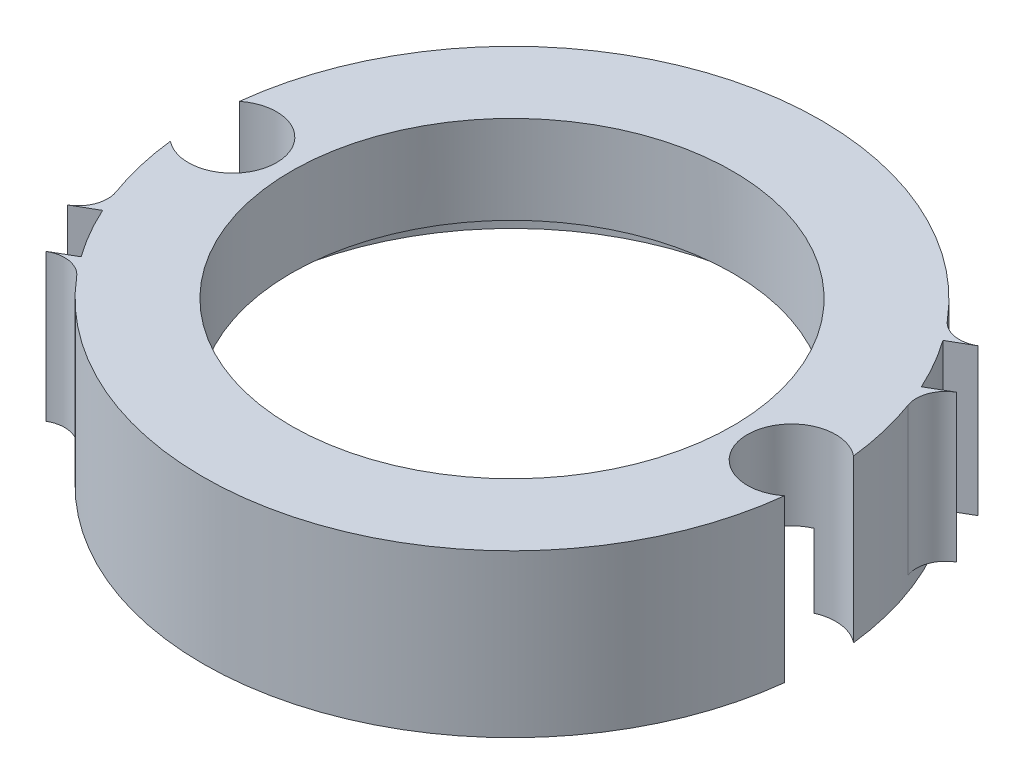
ISO-10303-21;
HEADER;
FILE_DESCRIPTION(('STEP AP214'),'2;1');
FILE_NAME('part.step','',(''),(''),'','','');
FILE_SCHEMA(('AUTOMOTIVE_DESIGN { 1 0 10303 214 1 1 1 1 }'));
ENDSEC;
DATA;
#1=APPLICATION_CONTEXT('core data for automotive mechanical design processes');
#2=APPLICATION_PROTOCOL_DEFINITION('international standard','automotive_design',2000,#1);
#3=PRODUCT_CONTEXT('',#1,'mechanical');
#4=PRODUCT('Part','Part','',(#3));
#5=PRODUCT_RELATED_PRODUCT_CATEGORY('part','',(#4));
#6=PRODUCT_DEFINITION_FORMATION('','',#4);
#7=PRODUCT_DEFINITION_CONTEXT('part definition',#1,'design');
#8=PRODUCT_DEFINITION('design','',#6,#7);
#9=PRODUCT_DEFINITION_SHAPE('','',#8);
#10=(LENGTH_UNIT() NAMED_UNIT(*) SI_UNIT(.MILLI.,.METRE.));
#11=(NAMED_UNIT(*) PLANE_ANGLE_UNIT() SI_UNIT($,.RADIAN.));
#12=(NAMED_UNIT(*) SI_UNIT($,.STERADIAN.) SOLID_ANGLE_UNIT());
#13=UNCERTAINTY_MEASURE_WITH_UNIT(LENGTH_MEASURE(1.E-05),#10,'distance_accuracy_value','');
#14=(GEOMETRIC_REPRESENTATION_CONTEXT(3) GLOBAL_UNCERTAINTY_ASSIGNED_CONTEXT((#13)) GLOBAL_UNIT_ASSIGNED_CONTEXT((#10,
#11,#12)) REPRESENTATION_CONTEXT('',''));
#15=CARTESIAN_POINT('',(0.,0.,0.));
#16=DIRECTION('',(0.,0.,1.));
#17=DIRECTION('',(1.,0.,0.));
#18=AXIS2_PLACEMENT_3D('',#15,#16,#17);
#19=CARTESIAN_POINT('',(8.80752262296651,5.,-7.39442663402194));
#20=DIRECTION('',(0.,-1.,0.));
#21=DIRECTION('',(0.,0.,-1.));
#22=AXIS2_PLACEMENT_3D('',#19,#20,#21);
#23=CYLINDRICAL_SURFACE('',#22,1.);
#24=CARTESIAN_POINT('',(0.,0.7,0.));
#25=DIRECTION('',(0.,-1.,0.));
#26=DIRECTION('',(0.,0.,-1.));
#27=AXIS2_PLACEMENT_3D('',#24,#25,#26);
#28=CIRCLE('',#27,10.5);
#29=CARTESIAN_POINT('',(8.04165109053465,0.7,-6.75143301367221));
#30=VERTEX_POINT('',#29);
#31=CARTESIAN_POINT('',(8.04346665274926,0.7,-6.74926990170868));
#32=VERTEX_POINT('',#31);
#33=EDGE_CURVE('E205',#30,#32,#28,.T.);
#34=ORIENTED_EDGE('',*,*,#33,.F.);
#35=DIRECTION('',(0.,-1.,0.));
#36=VECTOR('',#35,1.);
#37=CARTESIAN_POINT('',(8.04165109053465,5.,-6.75143301367221));
#38=LINE('',#37,#36);
#39=CARTESIAN_POINT('',(8.04165109053465,5.,-6.75143301367221));
#40=VERTEX_POINT('',#39);
#41=EDGE_CURVE('E332',#40,#30,#38,.T.);
#42=ORIENTED_EDGE('',*,*,#41,.F.);
#43=CARTESIAN_POINT('',(8.80752262296651,5.,-7.39442663402194));
#44=DIRECTION('',(0.,1.,0.));
#45=DIRECTION('',(0.,0.,1.));
#46=AXIS2_PLACEMENT_3D('',#43,#44,#45);
#47=CIRCLE('',#46,1.);
#48=CARTESIAN_POINT('',(9.30752262296651,5.,-6.5284012302375));
#49=VERTEX_POINT('',#48);
#50=EDGE_CURVE('E272',#49,#40,#47,.F.);
#51=ORIENTED_EDGE('',*,*,#50,.F.);
#52=DIRECTION('',(0.,-1.,0.));
#53=VECTOR('',#52,1.);
#54=CARTESIAN_POINT('',(9.30752262296651,0.,-6.5284012302375));
#55=LINE('',#54,#53);
#56=CARTESIAN_POINT('',(9.30752262296651,0.,-6.5284012302375));
#57=VERTEX_POINT('',#56);
#58=EDGE_CURVE('E342',#57,#49,#55,.F.);
#59=ORIENTED_EDGE('',*,*,#58,.F.);
#60=CARTESIAN_POINT('',(8.80752262296651,0.,-7.39442663402194));
#61=DIRECTION('',(0.,1.,0.));
#62=DIRECTION('',(0.,0.,1.));
#63=AXIS2_PLACEMENT_3D('',#60,#61,#62);
#64=CIRCLE('',#63,1.);
#65=CARTESIAN_POINT('',(8.04346665274926,0.,-6.74926990170868));
#66=VERTEX_POINT('',#65);
#67=EDGE_CURVE('E270',#66,#57,#64,.T.);
#68=ORIENTED_EDGE('',*,*,#67,.F.);
#69=DIRECTION('',(0.,-1.,0.));
#70=VECTOR('',#69,1.);
#71=CARTESIAN_POINT('',(8.04346665274926,0.7,-6.74926990170868));
#72=LINE('',#71,#70);
#73=EDGE_CURVE('E39',#32,#66,#72,.T.);
#74=ORIENTED_EDGE('',*,*,#73,.F.);
#75=EDGE_LOOP('',(#34,#42,#51,#59,#68,#74));
#76=FACE_BOUND('',#75,.T.);
#77=ADVANCED_FACE('F35',(#76),#23,.F.);
#78=CARTESIAN_POINT('',(0.,-0.5,0.));
#79=DIRECTION('',(0.,1.,0.));
#80=DIRECTION('',(0.,0.,1.));
#81=AXIS2_PLACEMENT_3D('',#78,#79,#80);
#82=PLANE('',#81);
#83=DIRECTION('',(0.766044443118977,0.,-0.642787609686541));
#84=VECTOR('',#83,1.);
#85=CARTESIAN_POINT('',(0.,-0.5,0.));
#86=LINE('',#85,#84);
#87=CARTESIAN_POINT('',(6.89439998807079,-0.5,-5.78508848717887));
#88=VERTEX_POINT('',#87);
#89=CARTESIAN_POINT('',(8.04346665274926,-0.5,-6.74926990170868));
#90=VERTEX_POINT('',#89);
#91=EDGE_CURVE('E300',#88,#90,#86,.T.);
#92=ORIENTED_EDGE('',*,*,#91,.T.);
#93=CARTESIAN_POINT('',(0.,-0.5,0.));
#94=DIRECTION('',(0.,1.,0.));
#95=DIRECTION('',(0.,0.,1.));
#96=AXIS2_PLACEMENT_3D('',#93,#94,#95);
#97=CIRCLE('',#96,10.5);
#98=CARTESIAN_POINT('',(10.4342105263158,-0.5,-1.17356324606763));
#99=VERTEX_POINT('',#98);
#100=EDGE_CURVE('E256',#99,#90,#97,.T.);
#101=ORIENTED_EDGE('',*,*,#100,.F.);
#102=CARTESIAN_POINT('',(9.5,-0.5,0.));
#103=DIRECTION('',(0.,1.,0.));
#104=DIRECTION('',(0.,0.,1.));
#105=AXIS2_PLACEMENT_3D('',#102,#103,#104);
#106=CIRCLE('',#105,1.50000000000001);
#107=CARTESIAN_POINT('',(8.89473684210526,-0.5,-1.3724636642532));
#108=VERTEX_POINT('',#107);
#109=EDGE_CURVE('E219',#99,#108,#106,.T.);
#110=ORIENTED_EDGE('',*,*,#109,.T.);
#111=CARTESIAN_POINT('',(0.,-0.5,0.));
#112=DIRECTION('',(0.,-1.,0.));
#113=DIRECTION('',(0.,0.,-1.));
#114=AXIS2_PLACEMENT_3D('',#111,#112,#113);
#115=CIRCLE('',#114,9.);
#116=EDGE_CURVE('E298',#88,#108,#115,.T.);
#117=ORIENTED_EDGE('',*,*,#116,.F.);
#118=EDGE_LOOP('',(#92,#101,#110,#117));
#119=FACE_BOUND('',#118,.T.);
#120=ADVANCED_FACE('F297',(#119),#82,.F.);
#121=CARTESIAN_POINT('',(0.,5.,0.));
#122=DIRECTION('',(0.,-1.,0.));
#123=DIRECTION('',(0.,0.,-1.));
#124=AXIS2_PLACEMENT_3D('',#121,#122,#123);
#125=CYLINDRICAL_SURFACE('',#124,10.5);
#126=EDGE_CURVE('E274',#66,#90,#72,.T.);
#127=ORIENTED_EDGE('',*,*,#126,.F.);
#128=CARTESIAN_POINT('',(0.,0.,0.));
#129=DIRECTION('',(0.,1.,0.));
#130=DIRECTION('',(0.,0.,1.));
#131=AXIS2_PLACEMENT_3D('',#128,#129,#130);
#132=CIRCLE('',#131,10.5);
#133=CARTESIAN_POINT('',(8.55193349511584,0.,-6.09216164387616));
#134=VERTEX_POINT('',#133);
#135=EDGE_CURVE('E262',#134,#66,#132,.T.);
#136=ORIENTED_EDGE('',*,*,#135,.F.);
#137=DIRECTION('',(0.,1.,0.));
#138=VECTOR('',#137,1.);
#139=CARTESIAN_POINT('',(8.55193349511584,-0.5,-6.09216164387616));
#140=LINE('',#139,#138);
#141=CARTESIAN_POINT('',(8.55193349511584,5.,-6.09216164387616));
#142=VERTEX_POINT('',#141);
#143=EDGE_CURVE('E229',#134,#142,#140,.T.);
#144=ORIENTED_EDGE('',*,*,#143,.T.);
#145=CARTESIAN_POINT('',(0.,5.,0.));
#146=DIRECTION('',(0.,1.,0.));
#147=DIRECTION('',(0.,0.,1.));
#148=AXIS2_PLACEMENT_3D('',#145,#146,#147);
#149=CIRCLE('',#148,10.5);
#150=CARTESIAN_POINT('',(9.55193349511584,5.,-4.36011083630728));
#151=VERTEX_POINT('',#150);
#152=EDGE_CURVE('E261',#151,#142,#149,.T.);
#153=ORIENTED_EDGE('',*,*,#152,.F.);
#154=DIRECTION('',(0.,1.,0.));
#155=VECTOR('',#154,1.);
#156=CARTESIAN_POINT('',(9.55193349511584,-0.5,-4.36011083630728));
#157=LINE('',#156,#155);
#158=CARTESIAN_POINT('',(9.55193349511584,0.,-4.36011083630728));
#159=VERTEX_POINT('',#158);
#160=EDGE_CURVE('E232',#159,#151,#157,.T.);
#161=ORIENTED_EDGE('',*,*,#160,.F.);
#162=CARTESIAN_POINT('',(9.86773804705638,0.,-3.58855762593774));
#163=VERTEX_POINT('',#162);
#164=EDGE_CURVE('E257',#163,#159,#132,.T.);
#165=ORIENTED_EDGE('',*,*,#164,.F.);
#166=DIRECTION('',(0.,-1.,0.));
#167=VECTOR('',#166,1.);
#168=CARTESIAN_POINT('',(9.86773804705638,5.,-3.58855762593774));
#169=LINE('',#168,#167);
#170=CARTESIAN_POINT('',(9.86773804705638,5.,-3.58855762593774));
#171=VERTEX_POINT('',#170);
#172=EDGE_CURVE('E367',#163,#171,#169,.F.);
#173=ORIENTED_EDGE('',*,*,#172,.T.);
#174=CARTESIAN_POINT('',(0.,5.,0.));
#175=DIRECTION('',(0.,1.,0.));
#176=DIRECTION('',(0.,0.,1.));
#177=AXIS2_PLACEMENT_3D('',#174,#175,#176);
#178=CIRCLE('',#177,10.5);
#179=CARTESIAN_POINT('',(10.4342105263158,5.,-1.17356324606763));
#180=VERTEX_POINT('',#179);
#181=EDGE_CURVE('E363',#180,#171,#178,.T.);
#182=ORIENTED_EDGE('',*,*,#181,.F.);
#183=DIRECTION('',(0.,1.,0.));
#184=VECTOR('',#183,1.);
#185=CARTESIAN_POINT('',(10.4342105263158,-0.5,-1.17356324606763));
#186=LINE('',#185,#184);
#187=EDGE_CURVE('E222',#99,#180,#186,.T.);
#188=ORIENTED_EDGE('',*,*,#187,.F.);
#189=ORIENTED_EDGE('',*,*,#100,.T.);
#190=EDGE_LOOP('',(#127,#136,#144,#153,#161,#165,#173,#182,#188,#189));
#191=FACE_BOUND('',#190,.T.);
#192=ADVANCED_FACE('F389',(#191),#125,.T.);
#193=CARTESIAN_POINT('',(-10.4342105263158,0.7,-1.17356324606763));
#194=VERTEX_POINT('',#193);
#195=EDGE_CURVE('E433',#194,#30,#28,.T.);
#196=ORIENTED_EDGE('',*,*,#195,.F.);
#197=DIRECTION('',(0.,1.,0.));
#198=VECTOR('',#197,1.);
#199=CARTESIAN_POINT('',(-10.4342105263158,-0.5,-1.17356324606763));
#200=LINE('',#199,#198);
#201=CARTESIAN_POINT('',(-10.4342105263158,5.,-1.17356324606763));
#202=VERTEX_POINT('',#201);
#203=EDGE_CURVE('E204',#194,#202,#200,.T.);
#204=ORIENTED_EDGE('',*,*,#203,.T.);
#205=EDGE_CURVE('E460',#40,#202,#178,.T.);
#206=ORIENTED_EDGE('',*,*,#205,.F.);
#207=ORIENTED_EDGE('',*,*,#41,.T.);
#208=EDGE_LOOP('',(#196,#204,#206,#207));
#209=FACE_BOUND('',#208,.T.);
#210=ADVANCED_FACE('F390',(#209),#125,.T.);
#211=CARTESIAN_POINT('',(-9.5,-0.5,0.));
#212=DIRECTION('',(0.,1.,0.));
#213=DIRECTION('',(0.,0.,1.));
#214=AXIS2_PLACEMENT_3D('',#211,#212,#213);
#215=CYLINDRICAL_SURFACE('',#214,1.50000000000001);
#216=CARTESIAN_POINT('',(-9.5,0.7,0.));
#217=DIRECTION('',(0.,-1.,0.));
#218=DIRECTION('',(0.,0.,-1.));
#219=AXIS2_PLACEMENT_3D('',#216,#217,#218);
#220=CIRCLE('',#219,1.50000000000001);
#221=CARTESIAN_POINT('',(-8.89473684210526,0.7,-1.3724636642532));
#222=VERTEX_POINT('',#221);
#223=EDGE_CURVE('E192',#222,#194,#220,.F.);
#224=ORIENTED_EDGE('',*,*,#223,.F.);
#225=DIRECTION('',(0.,-1.,0.));
#226=VECTOR('',#225,1.);
#227=CARTESIAN_POINT('',(-8.89473684210526,0.75,-1.3724636642532));
#228=LINE('',#227,#226);
#229=CARTESIAN_POINT('',(-8.89473684210526,2.,-1.3724636642532));
#230=VERTEX_POINT('',#229);
#231=EDGE_CURVE('E202',#222,#230,#228,.F.);
#232=ORIENTED_EDGE('',*,*,#231,.T.);
#233=CARTESIAN_POINT('',(-9.5,2.,0.));
#234=DIRECTION('',(0.,-1.,0.));
#235=DIRECTION('',(0.,0.,-1.));
#236=AXIS2_PLACEMENT_3D('',#233,#234,#235);
#237=CIRCLE('',#236,1.50000000000001);
#238=CARTESIAN_POINT('',(-8.89473684210526,2.,1.3724636642532));
#239=VERTEX_POINT('',#238);
#240=EDGE_CURVE('E425',#239,#230,#237,.F.);
#241=ORIENTED_EDGE('',*,*,#240,.F.);
#242=DIRECTION('',(0.,-1.,0.));
#243=VECTOR('',#242,1.);
#244=CARTESIAN_POINT('',(-8.89473684210526,0.75,1.3724636642532));
#245=LINE('',#244,#243);
#246=CARTESIAN_POINT('',(-8.89473684210526,-0.5,1.3724636642532));
#247=VERTEX_POINT('',#246);
#248=EDGE_CURVE('E209',#239,#247,#245,.T.);
#249=ORIENTED_EDGE('',*,*,#248,.T.);
#250=CARTESIAN_POINT('',(-9.5,-0.5,0.));
#251=DIRECTION('',(0.,1.,0.));
#252=DIRECTION('',(0.,0.,1.));
#253=AXIS2_PLACEMENT_3D('',#250,#251,#252);
#254=CIRCLE('',#253,1.50000000000001);
#255=CARTESIAN_POINT('',(-10.4342105263158,-0.5,1.17356324606764));
#256=VERTEX_POINT('',#255);
#257=EDGE_CURVE('E227',#256,#247,#254,.T.);
#258=ORIENTED_EDGE('',*,*,#257,.F.);
#259=DIRECTION('',(0.,1.,0.));
#260=VECTOR('',#259,1.);
#261=CARTESIAN_POINT('',(-10.4342105263158,-0.5,1.17356324606764));
#262=LINE('',#261,#260);
#263=CARTESIAN_POINT('',(-10.4342105263158,5.,1.17356324606764));
#264=VERTEX_POINT('',#263);
#265=EDGE_CURVE('E452',#256,#264,#262,.T.);
#266=ORIENTED_EDGE('',*,*,#265,.T.);
#267=CARTESIAN_POINT('',(-9.5,5.,0.));
#268=DIRECTION('',(0.,1.,0.));
#269=DIRECTION('',(0.,0.,1.));
#270=AXIS2_PLACEMENT_3D('',#267,#268,#269);
#271=CIRCLE('',#270,1.5);
#272=EDGE_CURVE('E464',#264,#202,#271,.T.);
#273=ORIENTED_EDGE('',*,*,#272,.T.);
#274=ORIENTED_EDGE('',*,*,#203,.F.);
#275=EDGE_LOOP('',(#224,#232,#241,#249,#258,#266,#273,#274));
#276=FACE_BOUND('',#275,.T.);
#277=ADVANCED_FACE('F200',(#276),#215,.F.);
#278=CARTESIAN_POINT('',(0.,2.,0.));
#279=DIRECTION('',(0.,-1.,0.));
#280=DIRECTION('',(0.,0.,-1.));
#281=AXIS2_PLACEMENT_3D('',#278,#279,#280);
#282=CYLINDRICAL_SURFACE('',#281,9.);
#283=DIRECTION('',(0.,-1.,0.));
#284=VECTOR('',#283,1.);
#285=CARTESIAN_POINT('',(6.89439998807079,0.7,-5.78508848717887));
#286=LINE('',#285,#284);
#287=CARTESIAN_POINT('',(6.89439998807079,0.7,-5.78508848717887));
#288=VERTEX_POINT('',#287);
#289=EDGE_CURVE('E432',#288,#88,#286,.T.);
#290=ORIENTED_EDGE('',*,*,#289,.T.);
#291=ORIENTED_EDGE('',*,*,#116,.T.);
#292=DIRECTION('',(0.,-1.,0.));
#293=VECTOR('',#292,1.);
#294=CARTESIAN_POINT('',(8.89473684210526,0.75,-1.3724636642532));
#295=LINE('',#294,#293);
#296=CARTESIAN_POINT('',(8.89473684210526,2.,-1.3724636642532));
#297=VERTEX_POINT('',#296);
#298=EDGE_CURVE('E45',#297,#108,#295,.T.);
#299=ORIENTED_EDGE('',*,*,#298,.F.);
#300=CARTESIAN_POINT('',(0.,2.,0.));
#301=DIRECTION('',(0.,-1.,0.));
#302=DIRECTION('',(0.,0.,-1.));
#303=AXIS2_PLACEMENT_3D('',#300,#301,#302);
#304=CIRCLE('',#303,9.);
#305=EDGE_CURVE('E61',#230,#297,#304,.T.);
#306=ORIENTED_EDGE('',*,*,#305,.F.);
#307=ORIENTED_EDGE('',*,*,#231,.F.);
#308=CARTESIAN_POINT('',(0.,0.7,0.));
#309=DIRECTION('',(0.,-1.,0.));
#310=DIRECTION('',(0.,0.,-1.));
#311=AXIS2_PLACEMENT_3D('',#308,#309,#310);
#312=CIRCLE('',#311,9.);
#313=EDGE_CURVE('E189',#288,#222,#312,.F.);
#314=ORIENTED_EDGE('',*,*,#313,.F.);
#315=EDGE_LOOP('',(#290,#291,#299,#306,#307,#314));
#316=FACE_BOUND('',#315,.T.);
#317=ADVANCED_FACE('F207',(#316),#282,.F.);
#318=CARTESIAN_POINT('',(0.,-0.5,0.));
#319=DIRECTION('',(0.,1.,0.));
#320=DIRECTION('',(0.,0.,1.));
#321=AXIS2_PLACEMENT_3D('',#318,#319,#320);
#322=CYLINDRICAL_SURFACE('',#321,7.5);
#323=CARTESIAN_POINT('',(0.,5.,0.));
#324=DIRECTION('',(0.,1.,0.));
#325=DIRECTION('',(0.,0.,1.));
#326=AXIS2_PLACEMENT_3D('',#323,#324,#325);
#327=CIRCLE('',#326,7.5);
#328=CARTESIAN_POINT('',(0.,5.,7.5));
#329=VERTEX_POINT('',#328);
#330=EDGE_CURVE('E250',#329,#329,#327,.T.);
#331=ORIENTED_EDGE('',*,*,#330,.T.);
#332=EDGE_LOOP('',(#331));
#333=FACE_BOUND('',#332,.T.);
#334=CARTESIAN_POINT('',(0.,2.,0.));
#335=DIRECTION('',(0.,-1.,0.));
#336=DIRECTION('',(0.,0.,-1.));
#337=AXIS2_PLACEMENT_3D('',#334,#335,#336);
#338=CIRCLE('',#337,7.5);
#339=CARTESIAN_POINT('',(0.,2.,-7.5));
#340=VERTEX_POINT('',#339);
#341=EDGE_CURVE('E215',#340,#340,#338,.F.);
#342=ORIENTED_EDGE('',*,*,#341,.F.);
#343=EDGE_LOOP('',(#342));
#344=FACE_BOUND('',#343,.T.);
#345=ADVANCED_FACE('F394',(#333,#344),#322,.F.);
#346=CARTESIAN_POINT('',(0.,0.,0.));
#347=DIRECTION('',(0.,1.,0.));
#348=DIRECTION('',(0.,0.,1.));
#349=AXIS2_PLACEMENT_3D('',#346,#347,#348);
#350=PLANE('',#349);
#351=ORIENTED_EDGE('',*,*,#135,.T.);
#352=ORIENTED_EDGE('',*,*,#67,.T.);
#353=DIRECTION('',(-0.866025403784439,0.,0.5));
#354=VECTOR('',#353,1.);
#355=CARTESIAN_POINT('',(-0.5,0.,-0.866025403784438));
#356=LINE('',#355,#354);
#357=EDGE_CURVE('E242',#57,#134,#356,.T.);
#358=ORIENTED_EDGE('',*,*,#357,.T.);
#359=EDGE_LOOP('',(#351,#352,#358));
#360=FACE_BOUND('',#359,.T.);
#361=ADVANCED_FACE('F381',(#360),#350,.F.);
#362=CARTESIAN_POINT('',(10.4342105263158,-0.5,1.17356324606763));
#363=VERTEX_POINT('',#362);
#364=EDGE_CURVE('E253',#256,#363,#97,.T.);
#365=ORIENTED_EDGE('',*,*,#364,.T.);
#366=DIRECTION('',(0.,1.,0.));
#367=VECTOR('',#366,1.);
#368=CARTESIAN_POINT('',(10.4342105263158,-0.5,1.17356324606763));
#369=LINE('',#368,#367);
#370=CARTESIAN_POINT('',(10.4342105263158,5.,1.17356324606763));
#371=VERTEX_POINT('',#370);
#372=EDGE_CURVE('E224',#363,#371,#369,.T.);
#373=ORIENTED_EDGE('',*,*,#372,.T.);
#374=CARTESIAN_POINT('',(-8.04165109053465,5.,6.75143301367221));
#375=VERTEX_POINT('',#374);
#376=EDGE_CURVE('E355',#375,#371,#178,.T.);
#377=ORIENTED_EDGE('',*,*,#376,.F.);
#378=DIRECTION('',(0.,-1.,0.));
#379=VECTOR('',#378,1.);
#380=CARTESIAN_POINT('',(-8.04165109053465,5.,6.75143301367221));
#381=LINE('',#380,#379);
#382=CARTESIAN_POINT('',(-8.04165109053465,0.,6.75143301367221));
#383=VERTEX_POINT('',#382);
#384=EDGE_CURVE('E361',#375,#383,#381,.T.);
#385=ORIENTED_EDGE('',*,*,#384,.T.);
#386=CARTESIAN_POINT('',(-8.55193349511584,0.,6.09216164387616));
#387=VERTEX_POINT('',#386);
#388=EDGE_CURVE('E263',#387,#383,#132,.T.);
#389=ORIENTED_EDGE('',*,*,#388,.F.);
#390=DIRECTION('',(0.,1.,0.));
#391=VECTOR('',#390,1.);
#392=CARTESIAN_POINT('',(-8.55193349511584,-0.5,6.09216164387616));
#393=LINE('',#392,#391);
#394=CARTESIAN_POINT('',(-8.55193349511584,5.,6.09216164387616));
#395=VERTEX_POINT('',#394);
#396=EDGE_CURVE('E208',#387,#395,#393,.T.);
#397=ORIENTED_EDGE('',*,*,#396,.T.);
#398=CARTESIAN_POINT('',(0.,5.,0.));
#399=DIRECTION('',(0.,1.,0.));
#400=DIRECTION('',(0.,0.,1.));
#401=AXIS2_PLACEMENT_3D('',#398,#399,#400);
#402=CIRCLE('',#401,10.5);
#403=CARTESIAN_POINT('',(-9.55193349511584,5.,4.36011083630728));
#404=VERTEX_POINT('',#403);
#405=EDGE_CURVE('E321',#404,#395,#402,.T.);
#406=ORIENTED_EDGE('',*,*,#405,.F.);
#407=DIRECTION('',(0.,1.,0.));
#408=VECTOR('',#407,1.);
#409=CARTESIAN_POINT('',(-9.55193349511584,-0.5,4.36011083630728));
#410=LINE('',#409,#408);
#411=CARTESIAN_POINT('',(-9.55193349511584,0.,4.36011083630728));
#412=VERTEX_POINT('',#411);
#413=EDGE_CURVE('E212',#412,#404,#410,.T.);
#414=ORIENTED_EDGE('',*,*,#413,.F.);
#415=CARTESIAN_POINT('',(-9.86773804705638,0.,3.58855762593774));
#416=VERTEX_POINT('',#415);
#417=EDGE_CURVE('E264',#416,#412,#132,.T.);
#418=ORIENTED_EDGE('',*,*,#417,.F.);
#419=DIRECTION('',(0.,-1.,0.));
#420=VECTOR('',#419,1.);
#421=CARTESIAN_POINT('',(-9.86773804705638,5.,3.58855762593774));
#422=LINE('',#421,#420);
#423=CARTESIAN_POINT('',(-9.86773804705638,5.,3.58855762593774));
#424=VERTEX_POINT('',#423);
#425=EDGE_CURVE('E318',#416,#424,#422,.F.);
#426=ORIENTED_EDGE('',*,*,#425,.T.);
#427=EDGE_CURVE('E364',#264,#424,#178,.T.);
#428=ORIENTED_EDGE('',*,*,#427,.F.);
#429=ORIENTED_EDGE('',*,*,#265,.F.);
#430=EDGE_LOOP('',(#365,#373,#377,#385,#389,#397,#406,#414,#418,#426,#428,#429));
#431=FACE_BOUND('',#430,.T.);
#432=ADVANCED_FACE('F316',(#431),#125,.T.);
#433=CARTESIAN_POINT('',(-8.80752262296652,0.,7.39442663402194));
#434=DIRECTION('',(0.,1.,0.));
#435=DIRECTION('',(0.,0.,1.));
#436=AXIS2_PLACEMENT_3D('',#433,#434,#435);
#437=CIRCLE('',#436,1.);
#438=CARTESIAN_POINT('',(-9.30752262296652,0.,6.5284012302375));
#439=VERTEX_POINT('',#438);
#440=EDGE_CURVE('E348',#383,#439,#437,.T.);
#441=ORIENTED_EDGE('',*,*,#440,.T.);
#442=DIRECTION('',(0.866025403784439,0.,-0.5));
#443=VECTOR('',#442,1.);
#444=CARTESIAN_POINT('',(0.499999999999999,0.,0.866025403784436));
#445=LINE('',#444,#443);
#446=EDGE_CURVE('E247',#439,#387,#445,.T.);
#447=ORIENTED_EDGE('',*,*,#446,.T.);
#448=ORIENTED_EDGE('',*,*,#388,.T.);
#449=EDGE_LOOP('',(#441,#447,#448));
#450=FACE_BOUND('',#449,.T.);
#451=ADVANCED_FACE('F377',(#450),#350,.F.);
#452=ORIENTED_EDGE('',*,*,#164,.T.);
#453=DIRECTION('',(0.866025403784439,0.,-0.5));
#454=VECTOR('',#453,1.);
#455=CARTESIAN_POINT('',(0.499999999999999,0.,0.866025403784437));
#456=LINE('',#455,#454);
#457=CARTESIAN_POINT('',(10.3075226229665,0.,-4.79635042266863));
#458=VERTEX_POINT('',#457);
#459=EDGE_CURVE('E449',#159,#458,#456,.T.);
#460=ORIENTED_EDGE('',*,*,#459,.T.);
#461=CARTESIAN_POINT('',(10.8075226229665,0.,-3.93032501888419));
#462=DIRECTION('',(0.,1.,0.));
#463=DIRECTION('',(0.,0.,1.));
#464=AXIS2_PLACEMENT_3D('',#461,#462,#463);
#465=CIRCLE('',#464,1.);
#466=EDGE_CURVE('E284',#458,#163,#465,.T.);
#467=ORIENTED_EDGE('',*,*,#466,.T.);
#468=EDGE_LOOP('',(#452,#460,#467));
#469=FACE_BOUND('',#468,.T.);
#470=ADVANCED_FACE('F379',(#469),#350,.F.);
#471=CARTESIAN_POINT('',(0.,5.,0.));
#472=DIRECTION('',(0.,1.,0.));
#473=DIRECTION('',(0.,0.,1.));
#474=AXIS2_PLACEMENT_3D('',#471,#472,#473);
#475=PLANE('',#474);
#476=ORIENTED_EDGE('',*,*,#330,.F.);
#477=EDGE_LOOP('',(#476));
#478=FACE_BOUND('',#477,.T.);
#479=CARTESIAN_POINT('',(-8.80752262296652,5.,7.39442663402194));
#480=DIRECTION('',(0.,1.,0.));
#481=DIRECTION('',(0.,0.,1.));
#482=AXIS2_PLACEMENT_3D('',#479,#480,#481);
#483=CIRCLE('',#482,1.);
#484=CARTESIAN_POINT('',(-9.30752262296652,5.,6.5284012302375));
#485=VERTEX_POINT('',#484);
#486=EDGE_CURVE('E350',#485,#375,#483,.F.);
#487=ORIENTED_EDGE('',*,*,#486,.T.);
#488=ORIENTED_EDGE('',*,*,#376,.T.);
#489=CARTESIAN_POINT('',(9.5,5.,0.));
#490=DIRECTION('',(0.,1.,0.));
#491=DIRECTION('',(0.,0.,1.));
#492=AXIS2_PLACEMENT_3D('',#489,#490,#491);
#493=CIRCLE('',#492,1.5);
#494=EDGE_CURVE('E372',#180,#371,#493,.T.);
#495=ORIENTED_EDGE('',*,*,#494,.F.);
#496=ORIENTED_EDGE('',*,*,#181,.T.);
#497=CARTESIAN_POINT('',(10.8075226229665,5.,-3.93032501888419));
#498=DIRECTION('',(0.,1.,0.));
#499=DIRECTION('',(0.,0.,1.));
#500=AXIS2_PLACEMENT_3D('',#497,#498,#499);
#501=CIRCLE('',#500,1.);
#502=CARTESIAN_POINT('',(10.3075226229665,5.,-4.79635042266863));
#503=VERTEX_POINT('',#502);
#504=EDGE_CURVE('E281',#171,#503,#501,.F.);
#505=ORIENTED_EDGE('',*,*,#504,.T.);
#506=DIRECTION('',(0.866025403784439,0.,-0.5));
#507=VECTOR('',#506,1.);
#508=CARTESIAN_POINT('',(0.499999999999999,5.,0.866025403784436));
#509=LINE('',#508,#507);
#510=EDGE_CURVE('E346',#151,#503,#509,.T.);
#511=ORIENTED_EDGE('',*,*,#510,.F.);
#512=ORIENTED_EDGE('',*,*,#152,.T.);
#513=DIRECTION('',(-0.866025403784439,0.,0.5));
#514=VECTOR('',#513,1.);
#515=CARTESIAN_POINT('',(-0.499999999999999,5.,-0.866025403784436));
#516=LINE('',#515,#514);
#517=EDGE_CURVE('E336',#49,#142,#516,.T.);
#518=ORIENTED_EDGE('',*,*,#517,.F.);
#519=ORIENTED_EDGE('',*,*,#50,.T.);
#520=ORIENTED_EDGE('',*,*,#205,.T.);
#521=ORIENTED_EDGE('',*,*,#272,.F.);
#522=ORIENTED_EDGE('',*,*,#427,.T.);
#523=CARTESIAN_POINT('',(-10.8075226229665,5.,3.93032501888419));
#524=DIRECTION('',(0.,1.,0.));
#525=DIRECTION('',(0.,0.,1.));
#526=AXIS2_PLACEMENT_3D('',#523,#524,#525);
#527=CIRCLE('',#526,1.);
#528=CARTESIAN_POINT('',(-10.3075226229665,5.,4.79635042266863));
#529=VERTEX_POINT('',#528);
#530=EDGE_CURVE('E330',#424,#529,#527,.F.);
#531=ORIENTED_EDGE('',*,*,#530,.T.);
#532=DIRECTION('',(-0.866025403784439,0.,0.5));
#533=VECTOR('',#532,1.);
#534=CARTESIAN_POINT('',(-0.499999999999999,5.,-0.866025403784436));
#535=LINE('',#534,#533);
#536=EDGE_CURVE('E325',#404,#529,#535,.T.);
#537=ORIENTED_EDGE('',*,*,#536,.F.);
#538=ORIENTED_EDGE('',*,*,#405,.T.);
#539=DIRECTION('',(0.866025403784439,0.,-0.5));
#540=VECTOR('',#539,1.);
#541=CARTESIAN_POINT('',(0.499999999999999,5.,0.866025403784436));
#542=LINE('',#541,#540);
#543=EDGE_CURVE('E356',#485,#395,#542,.T.);
#544=ORIENTED_EDGE('',*,*,#543,.F.);
#545=EDGE_LOOP('',(#487,#488,#495,#496,#505,#511,#512,#518,#519,#520,#521,#522,#531,#537,#538,#544));
#546=FACE_BOUND('',#545,.T.);
#547=ADVANCED_FACE('F328',(#478,#546),#475,.T.);
#548=ORIENTED_EDGE('',*,*,#417,.T.);
#549=DIRECTION('',(-0.866025403784439,0.,0.5));
#550=VECTOR('',#549,1.);
#551=CARTESIAN_POINT('',(-0.499999999999999,0.,-0.866025403784436));
#552=LINE('',#551,#550);
#553=CARTESIAN_POINT('',(-10.3075226229665,0.,4.79635042266863));
#554=VERTEX_POINT('',#553);
#555=EDGE_CURVE('E244',#412,#554,#552,.T.);
#556=ORIENTED_EDGE('',*,*,#555,.T.);
#557=CARTESIAN_POINT('',(-10.8075226229665,0.,3.93032501888419));
#558=DIRECTION('',(0.,1.,0.));
#559=DIRECTION('',(0.,0.,1.));
#560=AXIS2_PLACEMENT_3D('',#557,#558,#559);
#561=CIRCLE('',#560,1.);
#562=EDGE_CURVE('E273',#554,#416,#561,.T.);
#563=ORIENTED_EDGE('',*,*,#562,.T.);
#564=EDGE_LOOP('',(#548,#556,#563));
#565=FACE_BOUND('',#564,.T.);
#566=ADVANCED_FACE('F310',(#565),#350,.F.);
#567=CARTESIAN_POINT('',(-8.80752262296652,5.,7.39442663402194));
#568=DIRECTION('',(0.,-1.,0.));
#569=DIRECTION('',(0.,0.,-1.));
#570=AXIS2_PLACEMENT_3D('',#567,#568,#569);
#571=CYLINDRICAL_SURFACE('',#570,1.);
#572=ORIENTED_EDGE('',*,*,#486,.F.);
#573=DIRECTION('',(0.,-1.,0.));
#574=VECTOR('',#573,1.);
#575=CARTESIAN_POINT('',(-9.30752262296652,0.,6.5284012302375));
#576=LINE('',#575,#574);
#577=EDGE_CURVE('E369',#439,#485,#576,.F.);
#578=ORIENTED_EDGE('',*,*,#577,.F.);
#579=ORIENTED_EDGE('',*,*,#440,.F.);
#580=ORIENTED_EDGE('',*,*,#384,.F.);
#581=EDGE_LOOP('',(#572,#578,#579,#580));
#582=FACE_BOUND('',#581,.T.);
#583=ADVANCED_FACE('F366',(#582),#571,.F.);
#584=CARTESIAN_POINT('',(-10.8075226229665,5.,3.93032501888419));
#585=DIRECTION('',(0.,-1.,0.));
#586=DIRECTION('',(0.,0.,-1.));
#587=AXIS2_PLACEMENT_3D('',#584,#585,#586);
#588=CYLINDRICAL_SURFACE('',#587,1.);
#589=ORIENTED_EDGE('',*,*,#562,.F.);
#590=DIRECTION('',(0.,-1.,0.));
#591=VECTOR('',#590,1.);
#592=CARTESIAN_POINT('',(-10.3075226229665,0.,4.79635042266863));
#593=LINE('',#592,#591);
#594=EDGE_CURVE('E333',#529,#554,#593,.T.);
#595=ORIENTED_EDGE('',*,*,#594,.F.);
#596=ORIENTED_EDGE('',*,*,#530,.F.);
#597=ORIENTED_EDGE('',*,*,#425,.F.);
#598=EDGE_LOOP('',(#589,#595,#596,#597));
#599=FACE_BOUND('',#598,.T.);
#600=ADVANCED_FACE('F405',(#599),#588,.F.);
#601=CARTESIAN_POINT('',(10.8075226229665,5.,-3.93032501888419));
#602=DIRECTION('',(0.,-1.,0.));
#603=DIRECTION('',(0.,0.,-1.));
#604=AXIS2_PLACEMENT_3D('',#601,#602,#603);
#605=CYLINDRICAL_SURFACE('',#604,1.);
#606=ORIENTED_EDGE('',*,*,#466,.F.);
#607=DIRECTION('',(0.,-1.,0.));
#608=VECTOR('',#607,1.);
#609=CARTESIAN_POINT('',(10.3075226229665,0.,-4.79635042266863));
#610=LINE('',#609,#608);
#611=EDGE_CURVE('E344',#503,#458,#610,.T.);
#612=ORIENTED_EDGE('',*,*,#611,.F.);
#613=ORIENTED_EDGE('',*,*,#504,.F.);
#614=ORIENTED_EDGE('',*,*,#172,.F.);
#615=EDGE_LOOP('',(#606,#612,#613,#614));
#616=FACE_BOUND('',#615,.T.);
#617=ADVANCED_FACE('F37',(#616),#605,.F.);
#618=ORIENTED_EDGE('',*,*,#257,.T.);
#619=CARTESIAN_POINT('',(8.89473684210526,-0.5,1.3724636642532));
#620=VERTEX_POINT('',#619);
#621=EDGE_CURVE('E430',#620,#247,#115,.T.);
#622=ORIENTED_EDGE('',*,*,#621,.F.);
#623=EDGE_CURVE('E223',#620,#363,#106,.T.);
#624=ORIENTED_EDGE('',*,*,#623,.T.);
#625=ORIENTED_EDGE('',*,*,#364,.F.);
#626=EDGE_LOOP('',(#618,#622,#624,#625));
#627=FACE_BOUND('',#626,.T.);
#628=ADVANCED_FACE('F402',(#627),#82,.F.);
#629=CARTESIAN_POINT('',(9.5,-0.5,0.));
#630=DIRECTION('',(0.,1.,0.));
#631=DIRECTION('',(0.,0.,1.));
#632=AXIS2_PLACEMENT_3D('',#629,#630,#631);
#633=CYLINDRICAL_SURFACE('',#632,1.50000000000001);
#634=ORIENTED_EDGE('',*,*,#623,.F.);
#635=DIRECTION('',(0.,-1.,0.));
#636=VECTOR('',#635,1.);
#637=CARTESIAN_POINT('',(8.89473684210526,0.75,1.3724636642532));
#638=LINE('',#637,#636);
#639=CARTESIAN_POINT('',(8.89473684210526,2.,1.3724636642532));
#640=VERTEX_POINT('',#639);
#641=EDGE_CURVE('E11',#620,#640,#638,.F.);
#642=ORIENTED_EDGE('',*,*,#641,.T.);
#643=CARTESIAN_POINT('',(9.5,2.,0.));
#644=DIRECTION('',(0.,-1.,0.));
#645=DIRECTION('',(0.,0.,-1.));
#646=AXIS2_PLACEMENT_3D('',#643,#644,#645);
#647=CIRCLE('',#646,1.50000000000001);
#648=EDGE_CURVE('E286',#297,#640,#647,.F.);
#649=ORIENTED_EDGE('',*,*,#648,.F.);
#650=ORIENTED_EDGE('',*,*,#298,.T.);
#651=ORIENTED_EDGE('',*,*,#109,.F.);
#652=ORIENTED_EDGE('',*,*,#187,.T.);
#653=ORIENTED_EDGE('',*,*,#494,.T.);
#654=ORIENTED_EDGE('',*,*,#372,.F.);
#655=EDGE_LOOP('',(#634,#642,#649,#650,#651,#652,#653,#654));
#656=FACE_BOUND('',#655,.T.);
#657=ADVANCED_FACE('F291',(#656),#633,.F.);
#658=CARTESIAN_POINT('',(-0.5,-0.5,-0.866025403784438));
#659=DIRECTION('',(-0.5,0.,-0.866025403784439));
#660=DIRECTION('',(-0.866025403784439,0.,0.5));
#661=AXIS2_PLACEMENT_3D('',#658,#659,#660);
#662=PLANE('',#661);
#663=ORIENTED_EDGE('',*,*,#58,.T.);
#664=ORIENTED_EDGE('',*,*,#517,.T.);
#665=ORIENTED_EDGE('',*,*,#143,.F.);
#666=ORIENTED_EDGE('',*,*,#357,.F.);
#667=EDGE_LOOP('',(#663,#664,#665,#666));
#668=FACE_BOUND('',#667,.T.);
#669=ADVANCED_FACE('F496',(#668),#662,.F.);
#670=CARTESIAN_POINT('',(0.499999999999999,-0.5,0.866025403784437));
#671=DIRECTION('',(0.5,0.,0.866025403784439));
#672=DIRECTION('',(0.866025403784439,0.,-0.5));
#673=AXIS2_PLACEMENT_3D('',#670,#671,#672);
#674=PLANE('',#673);
#675=ORIENTED_EDGE('',*,*,#160,.T.);
#676=ORIENTED_EDGE('',*,*,#510,.T.);
#677=ORIENTED_EDGE('',*,*,#611,.T.);
#678=ORIENTED_EDGE('',*,*,#459,.F.);
#679=EDGE_LOOP('',(#675,#676,#677,#678));
#680=FACE_BOUND('',#679,.T.);
#681=ADVANCED_FACE('F472',(#680),#674,.F.);
#682=CARTESIAN_POINT('',(-0.499999999999999,-0.5,-0.866025403784436));
#683=DIRECTION('',(-0.5,0.,-0.866025403784439));
#684=DIRECTION('',(-0.866025403784439,0.,0.5));
#685=AXIS2_PLACEMENT_3D('',#682,#683,#684);
#686=PLANE('',#685);
#687=ORIENTED_EDGE('',*,*,#413,.T.);
#688=ORIENTED_EDGE('',*,*,#536,.T.);
#689=ORIENTED_EDGE('',*,*,#594,.T.);
#690=ORIENTED_EDGE('',*,*,#555,.F.);
#691=EDGE_LOOP('',(#687,#688,#689,#690));
#692=FACE_BOUND('',#691,.T.);
#693=ADVANCED_FACE('F324',(#692),#686,.F.);
#694=CARTESIAN_POINT('',(0.499999999999999,-0.5,0.866025403784436));
#695=DIRECTION('',(0.5,0.,0.866025403784439));
#696=DIRECTION('',(0.866025403784439,0.,-0.5));
#697=AXIS2_PLACEMENT_3D('',#694,#695,#696);
#698=PLANE('',#697);
#699=ORIENTED_EDGE('',*,*,#543,.T.);
#700=ORIENTED_EDGE('',*,*,#396,.F.);
#701=ORIENTED_EDGE('',*,*,#446,.F.);
#702=ORIENTED_EDGE('',*,*,#577,.T.);
#703=EDGE_LOOP('',(#699,#700,#701,#702));
#704=FACE_BOUND('',#703,.T.);
#705=ADVANCED_FACE('F376',(#704),#698,.F.);
#706=EDGE_CURVE('E426',#640,#239,#304,.T.);
#707=ORIENTED_EDGE('',*,*,#706,.F.);
#708=ORIENTED_EDGE('',*,*,#641,.F.);
#709=ORIENTED_EDGE('',*,*,#621,.T.);
#710=ORIENTED_EDGE('',*,*,#248,.F.);
#711=EDGE_LOOP('',(#707,#708,#709,#710));
#712=FACE_BOUND('',#711,.T.);
#713=ADVANCED_FACE('F480',(#712),#282,.F.);
#714=CARTESIAN_POINT('',(0.,2.,0.));
#715=DIRECTION('',(0.,-1.,0.));
#716=DIRECTION('',(0.,0.,-1.));
#717=AXIS2_PLACEMENT_3D('',#714,#715,#716);
#718=PLANE('',#717);
#719=ORIENTED_EDGE('',*,*,#240,.T.);
#720=ORIENTED_EDGE('',*,*,#305,.T.);
#721=ORIENTED_EDGE('',*,*,#648,.T.);
#722=ORIENTED_EDGE('',*,*,#706,.T.);
#723=EDGE_LOOP('',(#719,#720,#721,#722));
#724=FACE_BOUND('',#723,.T.);
#725=ORIENTED_EDGE('',*,*,#341,.T.);
#726=EDGE_LOOP('',(#725));
#727=FACE_BOUND('',#726,.T.);
#728=ADVANCED_FACE('F482',(#724,#727),#718,.T.);
#729=CARTESIAN_POINT('',(0.,0.7,0.));
#730=DIRECTION('',(-0.642787609686541,0.,-0.766044443118977));
#731=DIRECTION('',(-0.766044443118977,0.,0.642787609686541));
#732=AXIS2_PLACEMENT_3D('',#729,#730,#731);
#733=PLANE('',#732);
#734=ORIENTED_EDGE('',*,*,#91,.F.);
#735=ORIENTED_EDGE('',*,*,#289,.F.);
#736=DIRECTION('',(0.766044443118977,0.,-0.642787609686541));
#737=VECTOR('',#736,1.);
#738=CARTESIAN_POINT('',(0.,0.7,0.));
#739=LINE('',#738,#737);
#740=EDGE_CURVE('E53',#288,#32,#739,.T.);
#741=ORIENTED_EDGE('',*,*,#740,.T.);
#742=ORIENTED_EDGE('',*,*,#73,.T.);
#743=ORIENTED_EDGE('',*,*,#126,.T.);
#744=EDGE_LOOP('',(#734,#735,#741,#742,#743));
#745=FACE_BOUND('',#744,.T.);
#746=ADVANCED_FACE('F441',(#745),#733,.T.);
#747=CARTESIAN_POINT('',(0.,0.7,0.));
#748=DIRECTION('',(0.,-1.,0.));
#749=DIRECTION('',(0.,0.,-1.));
#750=AXIS2_PLACEMENT_3D('',#747,#748,#749);
#751=PLANE('',#750);
#752=ORIENTED_EDGE('',*,*,#740,.F.);
#753=ORIENTED_EDGE('',*,*,#313,.T.);
#754=ORIENTED_EDGE('',*,*,#223,.T.);
#755=ORIENTED_EDGE('',*,*,#195,.T.);
#756=ORIENTED_EDGE('',*,*,#33,.T.);
#757=EDGE_LOOP('',(#752,#753,#754,#755,#756));
#758=FACE_BOUND('',#757,.T.);
#759=ADVANCED_FACE('F191',(#758),#751,.T.);
#760=CLOSED_SHELL('',(#77,#120,#192,#210,#277,#317,#345,#361,#432,#451,#470,#547,#566,#583,#600,
#617,#628,#657,#669,#681,#693,#705,#713,#728,#746,#759));
#761=MANIFOLD_SOLID_BREP('B2',#760);
#762=ADVANCED_BREP_SHAPE_REPRESENTATION('',(#18,#761),#14);
#763=SHAPE_DEFINITION_REPRESENTATION(#9,#762);
ENDSEC;
END-ISO-10303-21;
